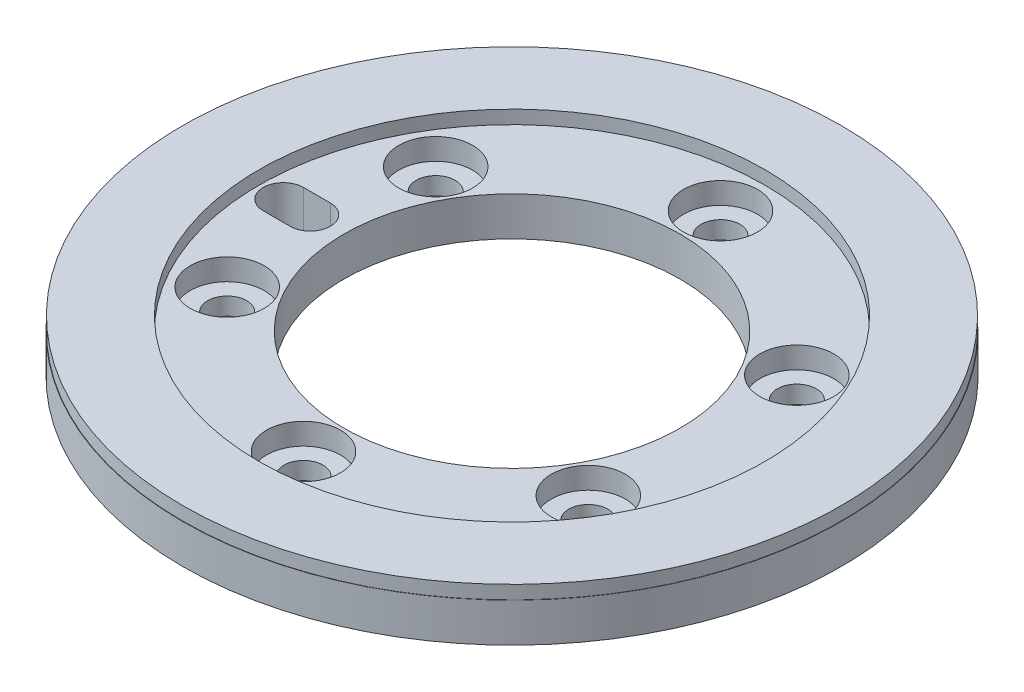
ISO-10303-21;
HEADER;
FILE_DESCRIPTION(('STEP AP214'),'2;1');
FILE_NAME('part.step','',(''),(''),'','','');
FILE_SCHEMA(('AUTOMOTIVE_DESIGN { 1 0 10303 214 1 1 1 1 }'));
ENDSEC;
DATA;
#1=APPLICATION_CONTEXT('core data for automotive mechanical design processes');
#2=APPLICATION_PROTOCOL_DEFINITION('international standard','automotive_design',2000,#1);
#3=PRODUCT_CONTEXT('',#1,'mechanical');
#4=PRODUCT('Part','Part','',(#3));
#5=PRODUCT_RELATED_PRODUCT_CATEGORY('part','',(#4));
#6=PRODUCT_DEFINITION_FORMATION('','',#4);
#7=PRODUCT_DEFINITION_CONTEXT('part definition',#1,'design');
#8=PRODUCT_DEFINITION('design','',#6,#7);
#9=PRODUCT_DEFINITION_SHAPE('','',#8);
#10=(LENGTH_UNIT() NAMED_UNIT(*) SI_UNIT(.MILLI.,.METRE.));
#11=(NAMED_UNIT(*) PLANE_ANGLE_UNIT() SI_UNIT($,.RADIAN.));
#12=(NAMED_UNIT(*) SI_UNIT($,.STERADIAN.) SOLID_ANGLE_UNIT());
#13=UNCERTAINTY_MEASURE_WITH_UNIT(LENGTH_MEASURE(1.E-05),#10,'distance_accuracy_value','');
#14=(GEOMETRIC_REPRESENTATION_CONTEXT(3) GLOBAL_UNCERTAINTY_ASSIGNED_CONTEXT((#13)) GLOBAL_UNIT_ASSIGNED_CONTEXT((#10,
#11,#12)) REPRESENTATION_CONTEXT('',''));
#15=CARTESIAN_POINT('',(0.,0.,0.));
#16=DIRECTION('',(0.,0.,1.));
#17=DIRECTION('',(1.,0.,0.));
#18=AXIS2_PLACEMENT_3D('',#15,#16,#17);
#19=CARTESIAN_POINT('',(-12.5,2.9,0.));
#20=DIRECTION('',(0.,-1.,0.));
#21=DIRECTION('',(0.,0.,-1.));
#22=AXIS2_PLACEMENT_3D('',#19,#20,#21);
#23=PLANE('',#22);
#24=CARTESIAN_POINT('',(0.,2.9,0.));
#25=DIRECTION('',(0.,-1.,0.));
#26=DIRECTION('',(0.,0.,-1.));
#27=AXIS2_PLACEMENT_3D('',#24,#25,#26);
#28=CIRCLE('',#27,24.5);
#29=CARTESIAN_POINT('',(0.,2.9,-24.5));
#30=VERTEX_POINT('',#29);
#31=EDGE_CURVE('E177',#30,#30,#28,.T.);
#32=ORIENTED_EDGE('',*,*,#31,.F.);
#33=EDGE_LOOP('',(#32));
#34=FACE_BOUND('',#33,.T.);
#35=CARTESIAN_POINT('',(0.,2.9,0.));
#36=DIRECTION('',(0.,-1.,0.));
#37=DIRECTION('',(0.,0.,-1.));
#38=AXIS2_PLACEMENT_3D('',#35,#36,#37);
#39=CIRCLE('',#38,24.475);
#40=CARTESIAN_POINT('',(0.,2.9,-24.475));
#41=VERTEX_POINT('',#40);
#42=EDGE_CURVE('E11',#41,#41,#39,.F.);
#43=ORIENTED_EDGE('',*,*,#42,.F.);
#44=EDGE_LOOP('',(#43));
#45=FACE_BOUND('',#44,.T.);
#46=ADVANCED_FACE('F31',(#34,#45),#23,.F.);
#47=CARTESIAN_POINT('',(0.,-3.24386032345393,0.));
#48=DIRECTION('',(0.,-1.,0.));
#49=DIRECTION('',(0.,0.,-1.));
#50=AXIS2_PLACEMENT_3D('',#47,#48,#49);
#51=CYLINDRICAL_SURFACE('',#50,12.5);
#52=CARTESIAN_POINT('',(0.,2.9,0.));
#53=DIRECTION('',(0.,-1.,0.));
#54=DIRECTION('',(0.,0.,-1.));
#55=AXIS2_PLACEMENT_3D('',#52,#53,#54);
#56=CIRCLE('',#55,12.5);
#57=CARTESIAN_POINT('',(0.,2.9,-12.5));
#58=VERTEX_POINT('',#57);
#59=EDGE_CURVE('E39',#58,#58,#56,.T.);
#60=ORIENTED_EDGE('',*,*,#59,.F.);
#61=EDGE_LOOP('',(#60));
#62=FACE_BOUND('',#61,.T.);
#63=CARTESIAN_POINT('',(0.,0.,0.));
#64=DIRECTION('',(0.,-1.,0.));
#65=DIRECTION('',(0.,0.,-1.));
#66=AXIS2_PLACEMENT_3D('',#63,#64,#65);
#67=CIRCLE('',#66,12.5);
#68=CARTESIAN_POINT('',(0.,0.,-12.5));
#69=VERTEX_POINT('',#68);
#70=EDGE_CURVE('E171',#69,#69,#67,.T.);
#71=ORIENTED_EDGE('',*,*,#70,.T.);
#72=EDGE_LOOP('',(#71));
#73=FACE_BOUND('',#72,.T.);
#74=ADVANCED_FACE('F33',(#62,#73),#51,.F.);
#75=CARTESIAN_POINT('',(0.,2.9,0.));
#76=DIRECTION('',(0.,1.,0.));
#77=DIRECTION('',(0.,0.,1.));
#78=AXIS2_PLACEMENT_3D('',#75,#76,#77);
#79=CIRCLE('',#78,18.8);
#80=CARTESIAN_POINT('',(0.,2.9,18.8));
#81=VERTEX_POINT('',#80);
#82=EDGE_CURVE('E235',#81,#81,#79,.T.);
#83=ORIENTED_EDGE('',*,*,#82,.T.);
#84=EDGE_LOOP('',(#83));
#85=FACE_BOUND('',#84,.T.);
#86=DIRECTION('',(-1.,0.,0.));
#87=VECTOR('',#86,1.);
#88=CARTESIAN_POINT('',(-15.,2.9,-1.5));
#89=LINE('',#88,#87);
#90=CARTESIAN_POINT('',(-15.,2.9,-1.5));
#91=VERTEX_POINT('',#90);
#92=CARTESIAN_POINT('',(-17.,2.9,-1.5));
#93=VERTEX_POINT('',#92);
#94=EDGE_CURVE('E102',#91,#93,#89,.T.);
#95=ORIENTED_EDGE('',*,*,#94,.F.);
#96=CARTESIAN_POINT('',(-15.,2.9,0.));
#97=DIRECTION('',(0.,1.,0.));
#98=DIRECTION('',(0.,0.,1.));
#99=AXIS2_PLACEMENT_3D('',#96,#97,#98);
#100=CIRCLE('',#99,1.5);
#101=CARTESIAN_POINT('',(-15.,2.9,1.5));
#102=VERTEX_POINT('',#101);
#103=EDGE_CURVE('E46',#102,#91,#100,.T.);
#104=ORIENTED_EDGE('',*,*,#103,.F.);
#105=DIRECTION('',(1.,0.,0.));
#106=VECTOR('',#105,1.);
#107=CARTESIAN_POINT('',(-15.,2.9,1.5));
#108=LINE('',#107,#106);
#109=CARTESIAN_POINT('',(-17.,2.9,1.5));
#110=VERTEX_POINT('',#109);
#111=EDGE_CURVE('E90',#110,#102,#108,.T.);
#112=ORIENTED_EDGE('',*,*,#111,.F.);
#113=CARTESIAN_POINT('',(-17.,2.9,0.));
#114=DIRECTION('',(0.,1.,0.));
#115=DIRECTION('',(0.,0.,1.));
#116=AXIS2_PLACEMENT_3D('',#113,#114,#115);
#117=CIRCLE('',#116,1.5);
#118=EDGE_CURVE('E93',#93,#110,#117,.T.);
#119=ORIENTED_EDGE('',*,*,#118,.F.);
#120=EDGE_LOOP('',(#95,#104,#112,#119));
#121=FACE_BOUND('',#120,.T.);
#122=CARTESIAN_POINT('',(-13.4233937586587,2.9,-7.75000000000016));
#123=DIRECTION('',(0.,-1.,0.));
#124=DIRECTION('',(0.,0.,-1.));
#125=AXIS2_PLACEMENT_3D('',#122,#123,#124);
#126=CIRCLE('',#125,2.75);
#127=CARTESIAN_POINT('',(-13.4233937586587,2.9,-10.5000000000002));
#128=VERTEX_POINT('',#127);
#129=EDGE_CURVE('E120',#128,#128,#126,.T.);
#130=ORIENTED_EDGE('',*,*,#129,.T.);
#131=EDGE_LOOP('',(#130));
#132=FACE_BOUND('',#131,.T.);
#133=CARTESIAN_POINT('',(-13.4233937586589,2.9,7.74999999999987));
#134=DIRECTION('',(0.,-1.,0.));
#135=DIRECTION('',(0.,0.,-1.));
#136=AXIS2_PLACEMENT_3D('',#133,#134,#135);
#137=CIRCLE('',#136,2.75);
#138=CARTESIAN_POINT('',(-13.4233937586589,2.9,4.99999999999988));
#139=VERTEX_POINT('',#138);
#140=EDGE_CURVE('E130',#139,#139,#137,.T.);
#141=ORIENTED_EDGE('',*,*,#140,.T.);
#142=EDGE_LOOP('',(#141));
#143=FACE_BOUND('',#142,.T.);
#144=CARTESIAN_POINT('',(0.,2.9,15.5));
#145=DIRECTION('',(0.,-1.,0.));
#146=DIRECTION('',(0.,0.,-1.));
#147=AXIS2_PLACEMENT_3D('',#144,#145,#146);
#148=CIRCLE('',#147,2.75);
#149=CARTESIAN_POINT('',(0.,2.9,12.75));
#150=VERTEX_POINT('',#149);
#151=EDGE_CURVE('E140',#150,#150,#148,.T.);
#152=ORIENTED_EDGE('',*,*,#151,.T.);
#153=EDGE_LOOP('',(#152));
#154=FACE_BOUND('',#153,.T.);
#155=CARTESIAN_POINT('',(13.4233937586588,2.9,7.75000000000006));
#156=DIRECTION('',(0.,-1.,0.));
#157=DIRECTION('',(0.,0.,-1.));
#158=AXIS2_PLACEMENT_3D('',#155,#156,#157);
#159=CIRCLE('',#158,2.75);
#160=CARTESIAN_POINT('',(13.4233937586588,2.9,5.00000000000006));
#161=VERTEX_POINT('',#160);
#162=EDGE_CURVE('E150',#161,#161,#159,.T.);
#163=ORIENTED_EDGE('',*,*,#162,.T.);
#164=EDGE_LOOP('',(#163));
#165=FACE_BOUND('',#164,.T.);
#166=CARTESIAN_POINT('',(13.4233937586588,2.9,-7.74999999999997));
#167=DIRECTION('',(0.,-1.,0.));
#168=DIRECTION('',(0.,0.,-1.));
#169=AXIS2_PLACEMENT_3D('',#166,#167,#168);
#170=CIRCLE('',#169,2.75);
#171=CARTESIAN_POINT('',(13.4233937586588,2.9,-10.5));
#172=VERTEX_POINT('',#171);
#173=EDGE_CURVE('E160',#172,#172,#170,.T.);
#174=ORIENTED_EDGE('',*,*,#173,.T.);
#175=EDGE_LOOP('',(#174));
#176=FACE_BOUND('',#175,.T.);
#177=CARTESIAN_POINT('',(0.,2.9,-15.5));
#178=DIRECTION('',(0.,-1.,0.));
#179=DIRECTION('',(0.,0.,-1.));
#180=AXIS2_PLACEMENT_3D('',#177,#178,#179);
#181=CIRCLE('',#180,2.75);
#182=CARTESIAN_POINT('',(0.,2.9,-18.25));
#183=VERTEX_POINT('',#182);
#184=EDGE_CURVE('E170',#183,#183,#181,.T.);
#185=ORIENTED_EDGE('',*,*,#184,.T.);
#186=EDGE_LOOP('',(#185));
#187=FACE_BOUND('',#186,.T.);
#188=ORIENTED_EDGE('',*,*,#59,.T.);
#189=EDGE_LOOP('',(#188));
#190=FACE_BOUND('',#189,.T.);
#191=ADVANCED_FACE('F194',(#85,#121,#132,#143,#154,#165,#176,#187,#190),#23,.F.);
#192=CARTESIAN_POINT('',(0.,-3.24386032345393,0.));
#193=DIRECTION('',(0.,-1.,0.));
#194=DIRECTION('',(0.,0.,-1.));
#195=AXIS2_PLACEMENT_3D('',#192,#193,#194);
#196=CYLINDRICAL_SURFACE('',#195,24.5);
#197=CARTESIAN_POINT('',(0.,0.,0.));
#198=DIRECTION('',(0.,-1.,0.));
#199=DIRECTION('',(0.,0.,-1.));
#200=AXIS2_PLACEMENT_3D('',#197,#198,#199);
#201=CIRCLE('',#200,24.5);
#202=CARTESIAN_POINT('',(0.,0.,-24.5));
#203=VERTEX_POINT('',#202);
#204=EDGE_CURVE('E174',#203,#203,#201,.T.);
#205=ORIENTED_EDGE('',*,*,#204,.F.);
#206=EDGE_LOOP('',(#205));
#207=FACE_BOUND('',#206,.T.);
#208=ORIENTED_EDGE('',*,*,#31,.T.);
#209=EDGE_LOOP('',(#208));
#210=FACE_BOUND('',#209,.T.);
#211=ADVANCED_FACE('F226',(#207,#210),#196,.T.);
#212=CARTESIAN_POINT('',(-12.5,0.,0.));
#213=DIRECTION('',(0.,1.,0.));
#214=DIRECTION('',(0.,0.,1.));
#215=AXIS2_PLACEMENT_3D('',#212,#213,#214);
#216=PLANE('',#215);
#217=DIRECTION('',(1.,0.,0.));
#218=VECTOR('',#217,1.);
#219=CARTESIAN_POINT('',(-15.,0.,1.5));
#220=LINE('',#219,#218);
#221=CARTESIAN_POINT('',(-17.,0.,1.5));
#222=VERTEX_POINT('',#221);
#223=CARTESIAN_POINT('',(-15.,0.,1.5));
#224=VERTEX_POINT('',#223);
#225=EDGE_CURVE('E80',#222,#224,#220,.T.);
#226=ORIENTED_EDGE('',*,*,#225,.T.);
#227=CARTESIAN_POINT('',(-15.,0.,0.));
#228=DIRECTION('',(0.,1.,0.));
#229=DIRECTION('',(0.,0.,1.));
#230=AXIS2_PLACEMENT_3D('',#227,#228,#229);
#231=CIRCLE('',#230,1.5);
#232=CARTESIAN_POINT('',(-15.,0.,-1.5));
#233=VERTEX_POINT('',#232);
#234=EDGE_CURVE('E74',#224,#233,#231,.T.);
#235=ORIENTED_EDGE('',*,*,#234,.T.);
#236=DIRECTION('',(-1.,0.,0.));
#237=VECTOR('',#236,1.);
#238=CARTESIAN_POINT('',(-15.,0.,-1.5));
#239=LINE('',#238,#237);
#240=CARTESIAN_POINT('',(-17.,0.,-1.5));
#241=VERTEX_POINT('',#240);
#242=EDGE_CURVE('E83',#233,#241,#239,.T.);
#243=ORIENTED_EDGE('',*,*,#242,.T.);
#244=CARTESIAN_POINT('',(-17.,0.,0.));
#245=DIRECTION('',(0.,1.,0.));
#246=DIRECTION('',(0.,0.,1.));
#247=AXIS2_PLACEMENT_3D('',#244,#245,#246);
#248=CIRCLE('',#247,1.5);
#249=EDGE_CURVE('E54',#241,#222,#248,.T.);
#250=ORIENTED_EDGE('',*,*,#249,.T.);
#251=EDGE_LOOP('',(#226,#235,#243,#250));
#252=FACE_BOUND('',#251,.T.);
#253=CARTESIAN_POINT('',(-13.4233937586587,0.,-7.75000000000016));
#254=DIRECTION('',(0.,1.,0.));
#255=DIRECTION('',(0.,0.,1.));
#256=AXIS2_PLACEMENT_3D('',#253,#254,#255);
#257=CIRCLE('',#256,1.45);
#258=CARTESIAN_POINT('',(-13.4233937586587,0.,-6.30000000000016));
#259=VERTEX_POINT('',#258);
#260=EDGE_CURVE('E117',#259,#259,#257,.T.);
#261=ORIENTED_EDGE('',*,*,#260,.T.);
#262=EDGE_LOOP('',(#261));
#263=FACE_BOUND('',#262,.T.);
#264=CARTESIAN_POINT('',(-13.4233937586589,0.,7.74999999999987));
#265=DIRECTION('',(0.,1.,0.));
#266=DIRECTION('',(0.,0.,1.));
#267=AXIS2_PLACEMENT_3D('',#264,#265,#266);
#268=CIRCLE('',#267,1.45);
#269=CARTESIAN_POINT('',(-13.4233937586589,0.,9.19999999999987));
#270=VERTEX_POINT('',#269);
#271=EDGE_CURVE('E127',#270,#270,#268,.T.);
#272=ORIENTED_EDGE('',*,*,#271,.T.);
#273=EDGE_LOOP('',(#272));
#274=FACE_BOUND('',#273,.T.);
#275=CARTESIAN_POINT('',(0.,0.,15.5));
#276=DIRECTION('',(0.,1.,0.));
#277=DIRECTION('',(0.,0.,1.));
#278=AXIS2_PLACEMENT_3D('',#275,#276,#277);
#279=CIRCLE('',#278,1.45);
#280=CARTESIAN_POINT('',(0.,0.,16.95));
#281=VERTEX_POINT('',#280);
#282=EDGE_CURVE('E137',#281,#281,#279,.T.);
#283=ORIENTED_EDGE('',*,*,#282,.T.);
#284=EDGE_LOOP('',(#283));
#285=FACE_BOUND('',#284,.T.);
#286=CARTESIAN_POINT('',(13.4233937586588,0.,7.75000000000006));
#287=DIRECTION('',(0.,1.,0.));
#288=DIRECTION('',(0.,0.,1.));
#289=AXIS2_PLACEMENT_3D('',#286,#287,#288);
#290=CIRCLE('',#289,1.45);
#291=CARTESIAN_POINT('',(13.4233937586588,0.,9.20000000000006));
#292=VERTEX_POINT('',#291);
#293=EDGE_CURVE('E147',#292,#292,#290,.T.);
#294=ORIENTED_EDGE('',*,*,#293,.T.);
#295=EDGE_LOOP('',(#294));
#296=FACE_BOUND('',#295,.T.);
#297=CARTESIAN_POINT('',(13.4233937586588,0.,-7.74999999999997));
#298=DIRECTION('',(0.,1.,0.));
#299=DIRECTION('',(0.,0.,1.));
#300=AXIS2_PLACEMENT_3D('',#297,#298,#299);
#301=CIRCLE('',#300,1.45);
#302=CARTESIAN_POINT('',(13.4233937586588,0.,-6.29999999999997));
#303=VERTEX_POINT('',#302);
#304=EDGE_CURVE('E157',#303,#303,#301,.T.);
#305=ORIENTED_EDGE('',*,*,#304,.T.);
#306=EDGE_LOOP('',(#305));
#307=FACE_BOUND('',#306,.T.);
#308=CARTESIAN_POINT('',(0.,0.,-15.5));
#309=DIRECTION('',(0.,1.,0.));
#310=DIRECTION('',(0.,0.,1.));
#311=AXIS2_PLACEMENT_3D('',#308,#309,#310);
#312=CIRCLE('',#311,1.45);
#313=CARTESIAN_POINT('',(0.,0.,-14.05));
#314=VERTEX_POINT('',#313);
#315=EDGE_CURVE('E167',#314,#314,#312,.T.);
#316=ORIENTED_EDGE('',*,*,#315,.T.);
#317=EDGE_LOOP('',(#316));
#318=FACE_BOUND('',#317,.T.);
#319=ORIENTED_EDGE('',*,*,#70,.F.);
#320=EDGE_LOOP('',(#319));
#321=FACE_BOUND('',#320,.T.);
#322=ORIENTED_EDGE('',*,*,#204,.T.);
#323=EDGE_LOOP('',(#322));
#324=FACE_BOUND('',#323,.T.);
#325=ADVANCED_FACE('F87',(#252,#263,#274,#285,#296,#307,#318,#321,#324),#216,.F.);
#326=CARTESIAN_POINT('',(0.,3.4,-15.5));
#327=DIRECTION('',(0.,1.,0.));
#328=DIRECTION('',(0.,0.,1.));
#329=AXIS2_PLACEMENT_3D('',#326,#327,#328);
#330=CYLINDRICAL_SURFACE('',#329,2.75);
#331=CARTESIAN_POINT('',(0.,1.3,-15.5));
#332=DIRECTION('',(0.,1.,0.));
#333=DIRECTION('',(0.,0.,1.));
#334=AXIS2_PLACEMENT_3D('',#331,#332,#333);
#335=CIRCLE('',#334,2.75);
#336=CARTESIAN_POINT('',(0.,1.3,-12.75));
#337=VERTEX_POINT('',#336);
#338=EDGE_CURVE('E161',#337,#337,#335,.T.);
#339=ORIENTED_EDGE('',*,*,#338,.F.);
#340=EDGE_LOOP('',(#339));
#341=FACE_BOUND('',#340,.T.);
#342=ORIENTED_EDGE('',*,*,#184,.F.);
#343=EDGE_LOOP('',(#342));
#344=FACE_BOUND('',#343,.T.);
#345=ADVANCED_FACE('F327',(#341,#344),#330,.F.);
#346=CARTESIAN_POINT('',(0.,3.4,-15.5));
#347=DIRECTION('',(0.,1.,0.));
#348=DIRECTION('',(0.,0.,1.));
#349=AXIS2_PLACEMENT_3D('',#346,#347,#348);
#350=CYLINDRICAL_SURFACE('',#349,1.45);
#351=ORIENTED_EDGE('',*,*,#315,.F.);
#352=EDGE_LOOP('',(#351));
#353=FACE_BOUND('',#352,.T.);
#354=CARTESIAN_POINT('',(0.,1.3,-15.5));
#355=DIRECTION('',(0.,1.,0.));
#356=DIRECTION('',(0.,0.,1.));
#357=AXIS2_PLACEMENT_3D('',#354,#355,#356);
#358=CIRCLE('',#357,1.45);
#359=CARTESIAN_POINT('',(0.,1.3,-14.05));
#360=VERTEX_POINT('',#359);
#361=EDGE_CURVE('E164',#360,#360,#358,.T.);
#362=ORIENTED_EDGE('',*,*,#361,.T.);
#363=EDGE_LOOP('',(#362));
#364=FACE_BOUND('',#363,.T.);
#365=ADVANCED_FACE('F470',(#353,#364),#350,.F.);
#366=CARTESIAN_POINT('',(1.45,1.3,-15.5));
#367=DIRECTION('',(0.,-1.,0.));
#368=DIRECTION('',(0.,0.,-1.));
#369=AXIS2_PLACEMENT_3D('',#366,#367,#368);
#370=PLANE('',#369);
#371=ORIENTED_EDGE('',*,*,#361,.F.);
#372=EDGE_LOOP('',(#371));
#373=FACE_BOUND('',#372,.T.);
#374=ORIENTED_EDGE('',*,*,#338,.T.);
#375=EDGE_LOOP('',(#374));
#376=FACE_BOUND('',#375,.T.);
#377=ADVANCED_FACE('F460',(#373,#376),#370,.F.);
#378=CARTESIAN_POINT('',(13.4233937586588,3.4,-7.74999999999997));
#379=DIRECTION('',(0.,1.,0.));
#380=DIRECTION('',(0.,0.,1.));
#381=AXIS2_PLACEMENT_3D('',#378,#379,#380);
#382=CYLINDRICAL_SURFACE('',#381,2.75);
#383=CARTESIAN_POINT('',(13.4233937586588,1.3,-7.74999999999997));
#384=DIRECTION('',(0.,1.,0.));
#385=DIRECTION('',(0.,0.,1.));
#386=AXIS2_PLACEMENT_3D('',#383,#384,#385);
#387=CIRCLE('',#386,2.75);
#388=CARTESIAN_POINT('',(13.4233937586588,1.3,-4.99999999999997));
#389=VERTEX_POINT('',#388);
#390=EDGE_CURVE('E151',#389,#389,#387,.T.);
#391=ORIENTED_EDGE('',*,*,#390,.F.);
#392=EDGE_LOOP('',(#391));
#393=FACE_BOUND('',#392,.T.);
#394=ORIENTED_EDGE('',*,*,#173,.F.);
#395=EDGE_LOOP('',(#394));
#396=FACE_BOUND('',#395,.T.);
#397=ADVANCED_FACE('F450',(#393,#396),#382,.F.);
#398=CARTESIAN_POINT('',(13.4233937586588,3.4,-7.74999999999997));
#399=DIRECTION('',(0.,1.,0.));
#400=DIRECTION('',(0.,0.,1.));
#401=AXIS2_PLACEMENT_3D('',#398,#399,#400);
#402=CYLINDRICAL_SURFACE('',#401,1.45);
#403=ORIENTED_EDGE('',*,*,#304,.F.);
#404=EDGE_LOOP('',(#403));
#405=FACE_BOUND('',#404,.T.);
#406=CARTESIAN_POINT('',(13.4233937586588,1.3,-7.74999999999997));
#407=DIRECTION('',(0.,1.,0.));
#408=DIRECTION('',(0.,0.,1.));
#409=AXIS2_PLACEMENT_3D('',#406,#407,#408);
#410=CIRCLE('',#409,1.45);
#411=CARTESIAN_POINT('',(13.4233937586588,1.3,-6.29999999999997));
#412=VERTEX_POINT('',#411);
#413=EDGE_CURVE('E154',#412,#412,#410,.T.);
#414=ORIENTED_EDGE('',*,*,#413,.T.);
#415=EDGE_LOOP('',(#414));
#416=FACE_BOUND('',#415,.T.);
#417=ADVANCED_FACE('F440',(#405,#416),#402,.F.);
#418=CARTESIAN_POINT('',(14.8733937586588,1.3,-7.74999999999997));
#419=DIRECTION('',(0.,-1.,0.));
#420=DIRECTION('',(0.,0.,-1.));
#421=AXIS2_PLACEMENT_3D('',#418,#419,#420);
#422=PLANE('',#421);
#423=ORIENTED_EDGE('',*,*,#413,.F.);
#424=EDGE_LOOP('',(#423));
#425=FACE_BOUND('',#424,.T.);
#426=ORIENTED_EDGE('',*,*,#390,.T.);
#427=EDGE_LOOP('',(#426));
#428=FACE_BOUND('',#427,.T.);
#429=ADVANCED_FACE('F430',(#425,#428),#422,.F.);
#430=CARTESIAN_POINT('',(13.4233937586588,3.4,7.75000000000006));
#431=DIRECTION('',(0.,1.,0.));
#432=DIRECTION('',(0.,0.,1.));
#433=AXIS2_PLACEMENT_3D('',#430,#431,#432);
#434=CYLINDRICAL_SURFACE('',#433,2.75);
#435=CARTESIAN_POINT('',(13.4233937586588,1.3,7.75000000000006));
#436=DIRECTION('',(0.,1.,0.));
#437=DIRECTION('',(0.,0.,1.));
#438=AXIS2_PLACEMENT_3D('',#435,#436,#437);
#439=CIRCLE('',#438,2.75);
#440=CARTESIAN_POINT('',(13.4233937586588,1.3,10.5000000000001));
#441=VERTEX_POINT('',#440);
#442=EDGE_CURVE('E141',#441,#441,#439,.T.);
#443=ORIENTED_EDGE('',*,*,#442,.F.);
#444=EDGE_LOOP('',(#443));
#445=FACE_BOUND('',#444,.T.);
#446=ORIENTED_EDGE('',*,*,#162,.F.);
#447=EDGE_LOOP('',(#446));
#448=FACE_BOUND('',#447,.T.);
#449=ADVANCED_FACE('F420',(#445,#448),#434,.F.);
#450=CARTESIAN_POINT('',(13.4233937586588,3.4,7.75000000000006));
#451=DIRECTION('',(0.,1.,0.));
#452=DIRECTION('',(0.,0.,1.));
#453=AXIS2_PLACEMENT_3D('',#450,#451,#452);
#454=CYLINDRICAL_SURFACE('',#453,1.45);
#455=ORIENTED_EDGE('',*,*,#293,.F.);
#456=EDGE_LOOP('',(#455));
#457=FACE_BOUND('',#456,.T.);
#458=CARTESIAN_POINT('',(13.4233937586588,1.3,7.75000000000006));
#459=DIRECTION('',(0.,1.,0.));
#460=DIRECTION('',(0.,0.,1.));
#461=AXIS2_PLACEMENT_3D('',#458,#459,#460);
#462=CIRCLE('',#461,1.45);
#463=CARTESIAN_POINT('',(13.4233937586588,1.3,9.20000000000006));
#464=VERTEX_POINT('',#463);
#465=EDGE_CURVE('E144',#464,#464,#462,.T.);
#466=ORIENTED_EDGE('',*,*,#465,.T.);
#467=EDGE_LOOP('',(#466));
#468=FACE_BOUND('',#467,.T.);
#469=ADVANCED_FACE('F410',(#457,#468),#454,.F.);
#470=CARTESIAN_POINT('',(14.8733937586588,1.3,7.75000000000006));
#471=DIRECTION('',(0.,-1.,0.));
#472=DIRECTION('',(0.,0.,-1.));
#473=AXIS2_PLACEMENT_3D('',#470,#471,#472);
#474=PLANE('',#473);
#475=ORIENTED_EDGE('',*,*,#465,.F.);
#476=EDGE_LOOP('',(#475));
#477=FACE_BOUND('',#476,.T.);
#478=ORIENTED_EDGE('',*,*,#442,.T.);
#479=EDGE_LOOP('',(#478));
#480=FACE_BOUND('',#479,.T.);
#481=ADVANCED_FACE('F400',(#477,#480),#474,.F.);
#482=CARTESIAN_POINT('',(0.,3.4,15.5));
#483=DIRECTION('',(0.,1.,0.));
#484=DIRECTION('',(0.,0.,1.));
#485=AXIS2_PLACEMENT_3D('',#482,#483,#484);
#486=CYLINDRICAL_SURFACE('',#485,2.75);
#487=CARTESIAN_POINT('',(0.,1.3,15.5));
#488=DIRECTION('',(0.,1.,0.));
#489=DIRECTION('',(0.,0.,1.));
#490=AXIS2_PLACEMENT_3D('',#487,#488,#489);
#491=CIRCLE('',#490,2.75);
#492=CARTESIAN_POINT('',(0.,1.3,18.25));
#493=VERTEX_POINT('',#492);
#494=EDGE_CURVE('E131',#493,#493,#491,.T.);
#495=ORIENTED_EDGE('',*,*,#494,.F.);
#496=EDGE_LOOP('',(#495));
#497=FACE_BOUND('',#496,.T.);
#498=ORIENTED_EDGE('',*,*,#151,.F.);
#499=EDGE_LOOP('',(#498));
#500=FACE_BOUND('',#499,.T.);
#501=ADVANCED_FACE('F390',(#497,#500),#486,.F.);
#502=CARTESIAN_POINT('',(0.,3.4,15.5));
#503=DIRECTION('',(0.,1.,0.));
#504=DIRECTION('',(0.,0.,1.));
#505=AXIS2_PLACEMENT_3D('',#502,#503,#504);
#506=CYLINDRICAL_SURFACE('',#505,1.45);
#507=ORIENTED_EDGE('',*,*,#282,.F.);
#508=EDGE_LOOP('',(#507));
#509=FACE_BOUND('',#508,.T.);
#510=CARTESIAN_POINT('',(0.,1.3,15.5));
#511=DIRECTION('',(0.,1.,0.));
#512=DIRECTION('',(0.,0.,1.));
#513=AXIS2_PLACEMENT_3D('',#510,#511,#512);
#514=CIRCLE('',#513,1.45);
#515=CARTESIAN_POINT('',(0.,1.3,16.95));
#516=VERTEX_POINT('',#515);
#517=EDGE_CURVE('E134',#516,#516,#514,.T.);
#518=ORIENTED_EDGE('',*,*,#517,.T.);
#519=EDGE_LOOP('',(#518));
#520=FACE_BOUND('',#519,.T.);
#521=ADVANCED_FACE('F380',(#509,#520),#506,.F.);
#522=CARTESIAN_POINT('',(1.45,1.3,15.5));
#523=DIRECTION('',(0.,-1.,0.));
#524=DIRECTION('',(0.,0.,-1.));
#525=AXIS2_PLACEMENT_3D('',#522,#523,#524);
#526=PLANE('',#525);
#527=ORIENTED_EDGE('',*,*,#517,.F.);
#528=EDGE_LOOP('',(#527));
#529=FACE_BOUND('',#528,.T.);
#530=ORIENTED_EDGE('',*,*,#494,.T.);
#531=EDGE_LOOP('',(#530));
#532=FACE_BOUND('',#531,.T.);
#533=ADVANCED_FACE('F370',(#529,#532),#526,.F.);
#534=CARTESIAN_POINT('',(-13.4233937586589,3.4,7.74999999999987));
#535=DIRECTION('',(0.,1.,0.));
#536=DIRECTION('',(0.,0.,1.));
#537=AXIS2_PLACEMENT_3D('',#534,#535,#536);
#538=CYLINDRICAL_SURFACE('',#537,2.75);
#539=CARTESIAN_POINT('',(-13.4233937586589,1.3,7.74999999999987));
#540=DIRECTION('',(0.,1.,0.));
#541=DIRECTION('',(0.,0.,1.));
#542=AXIS2_PLACEMENT_3D('',#539,#540,#541);
#543=CIRCLE('',#542,2.75);
#544=CARTESIAN_POINT('',(-13.4233937586589,1.3,10.4999999999999));
#545=VERTEX_POINT('',#544);
#546=EDGE_CURVE('E121',#545,#545,#543,.T.);
#547=ORIENTED_EDGE('',*,*,#546,.F.);
#548=EDGE_LOOP('',(#547));
#549=FACE_BOUND('',#548,.T.);
#550=ORIENTED_EDGE('',*,*,#140,.F.);
#551=EDGE_LOOP('',(#550));
#552=FACE_BOUND('',#551,.T.);
#553=ADVANCED_FACE('F360',(#549,#552),#538,.F.);
#554=CARTESIAN_POINT('',(-13.4233937586589,3.4,7.74999999999987));
#555=DIRECTION('',(0.,1.,0.));
#556=DIRECTION('',(0.,0.,1.));
#557=AXIS2_PLACEMENT_3D('',#554,#555,#556);
#558=CYLINDRICAL_SURFACE('',#557,1.45);
#559=ORIENTED_EDGE('',*,*,#271,.F.);
#560=EDGE_LOOP('',(#559));
#561=FACE_BOUND('',#560,.T.);
#562=CARTESIAN_POINT('',(-13.4233937586589,1.3,7.74999999999987));
#563=DIRECTION('',(0.,1.,0.));
#564=DIRECTION('',(0.,0.,1.));
#565=AXIS2_PLACEMENT_3D('',#562,#563,#564);
#566=CIRCLE('',#565,1.45);
#567=CARTESIAN_POINT('',(-13.4233937586589,1.3,9.19999999999987));
#568=VERTEX_POINT('',#567);
#569=EDGE_CURVE('E124',#568,#568,#566,.T.);
#570=ORIENTED_EDGE('',*,*,#569,.T.);
#571=EDGE_LOOP('',(#570));
#572=FACE_BOUND('',#571,.T.);
#573=ADVANCED_FACE('F210',(#561,#572),#558,.F.);
#574=CARTESIAN_POINT('',(-11.9733937586589,1.3,7.74999999999987));
#575=DIRECTION('',(0.,-1.,0.));
#576=DIRECTION('',(0.,0.,-1.));
#577=AXIS2_PLACEMENT_3D('',#574,#575,#576);
#578=PLANE('',#577);
#579=ORIENTED_EDGE('',*,*,#569,.F.);
#580=EDGE_LOOP('',(#579));
#581=FACE_BOUND('',#580,.T.);
#582=ORIENTED_EDGE('',*,*,#546,.T.);
#583=EDGE_LOOP('',(#582));
#584=FACE_BOUND('',#583,.T.);
#585=ADVANCED_FACE('F200',(#581,#584),#578,.F.);
#586=CARTESIAN_POINT('',(-13.4233937586587,3.4,-7.75000000000016));
#587=DIRECTION('',(0.,1.,0.));
#588=DIRECTION('',(0.,0.,1.));
#589=AXIS2_PLACEMENT_3D('',#586,#587,#588);
#590=CYLINDRICAL_SURFACE('',#589,2.75);
#591=CARTESIAN_POINT('',(-13.4233937586587,1.3,-7.75000000000016));
#592=DIRECTION('',(0.,1.,0.));
#593=DIRECTION('',(0.,0.,1.));
#594=AXIS2_PLACEMENT_3D('',#591,#592,#593);
#595=CIRCLE('',#594,2.75);
#596=CARTESIAN_POINT('',(-13.4233937586587,1.3,-5.00000000000016));
#597=VERTEX_POINT('',#596);
#598=EDGE_CURVE('E108',#597,#597,#595,.T.);
#599=ORIENTED_EDGE('',*,*,#598,.F.);
#600=EDGE_LOOP('',(#599));
#601=FACE_BOUND('',#600,.T.);
#602=ORIENTED_EDGE('',*,*,#129,.F.);
#603=EDGE_LOOP('',(#602));
#604=FACE_BOUND('',#603,.T.);
#605=ADVANCED_FACE('F197',(#601,#604),#590,.F.);
#606=CARTESIAN_POINT('',(-13.4233937586587,3.4,-7.75000000000016));
#607=DIRECTION('',(0.,1.,0.));
#608=DIRECTION('',(0.,0.,1.));
#609=AXIS2_PLACEMENT_3D('',#606,#607,#608);
#610=CYLINDRICAL_SURFACE('',#609,1.45);
#611=ORIENTED_EDGE('',*,*,#260,.F.);
#612=EDGE_LOOP('',(#611));
#613=FACE_BOUND('',#612,.T.);
#614=CARTESIAN_POINT('',(-13.4233937586587,1.3,-7.75000000000016));
#615=DIRECTION('',(0.,1.,0.));
#616=DIRECTION('',(0.,0.,1.));
#617=AXIS2_PLACEMENT_3D('',#614,#615,#616);
#618=CIRCLE('',#617,1.45);
#619=CARTESIAN_POINT('',(-13.4233937586587,1.3,-6.30000000000016));
#620=VERTEX_POINT('',#619);
#621=EDGE_CURVE('E114',#620,#620,#618,.T.);
#622=ORIENTED_EDGE('',*,*,#621,.T.);
#623=EDGE_LOOP('',(#622));
#624=FACE_BOUND('',#623,.T.);
#625=ADVANCED_FACE('F199',(#613,#624),#610,.F.);
#626=CARTESIAN_POINT('',(-11.9733937586587,1.3,-7.75000000000016));
#627=DIRECTION('',(0.,-1.,0.));
#628=DIRECTION('',(0.,0.,-1.));
#629=AXIS2_PLACEMENT_3D('',#626,#627,#628);
#630=PLANE('',#629);
#631=ORIENTED_EDGE('',*,*,#621,.F.);
#632=EDGE_LOOP('',(#631));
#633=FACE_BOUND('',#632,.T.);
#634=ORIENTED_EDGE('',*,*,#598,.T.);
#635=EDGE_LOOP('',(#634));
#636=FACE_BOUND('',#635,.T.);
#637=ADVANCED_FACE('F207',(#633,#636),#630,.F.);
#638=CARTESIAN_POINT('',(-15.,0.,0.));
#639=DIRECTION('',(0.,1.,0.));
#640=DIRECTION('',(0.,0.,1.));
#641=AXIS2_PLACEMENT_3D('',#638,#639,#640);
#642=CYLINDRICAL_SURFACE('',#641,1.5);
#643=ORIENTED_EDGE('',*,*,#103,.T.);
#644=DIRECTION('',(0.,1.,0.));
#645=VECTOR('',#644,1.);
#646=CARTESIAN_POINT('',(-15.,0.,-1.5));
#647=LINE('',#646,#645);
#648=EDGE_CURVE('E70',#233,#91,#647,.T.);
#649=ORIENTED_EDGE('',*,*,#648,.F.);
#650=ORIENTED_EDGE('',*,*,#234,.F.);
#651=DIRECTION('',(0.,1.,0.));
#652=VECTOR('',#651,1.);
#653=CARTESIAN_POINT('',(-15.,0.,1.5));
#654=LINE('',#653,#652);
#655=EDGE_CURVE('E106',#224,#102,#654,.T.);
#656=ORIENTED_EDGE('',*,*,#655,.T.);
#657=EDGE_LOOP('',(#643,#649,#650,#656));
#658=FACE_BOUND('',#657,.T.);
#659=ADVANCED_FACE('F72',(#658),#642,.F.);
#660=CARTESIAN_POINT('',(-15.,0.,1.5));
#661=DIRECTION('',(0.,0.,1.));
#662=DIRECTION('',(1.,0.,0.));
#663=AXIS2_PLACEMENT_3D('',#660,#661,#662);
#664=PLANE('',#663);
#665=ORIENTED_EDGE('',*,*,#111,.T.);
#666=ORIENTED_EDGE('',*,*,#655,.F.);
#667=ORIENTED_EDGE('',*,*,#225,.F.);
#668=DIRECTION('',(0.,1.,0.));
#669=VECTOR('',#668,1.);
#670=CARTESIAN_POINT('',(-17.,0.,1.5));
#671=LINE('',#670,#669);
#672=EDGE_CURVE('E109',#222,#110,#671,.T.);
#673=ORIENTED_EDGE('',*,*,#672,.T.);
#674=EDGE_LOOP('',(#665,#666,#667,#673));
#675=FACE_BOUND('',#674,.T.);
#676=ADVANCED_FACE('F240',(#675),#664,.F.);
#677=CARTESIAN_POINT('',(-17.,0.,0.));
#678=DIRECTION('',(0.,1.,0.));
#679=DIRECTION('',(0.,0.,1.));
#680=AXIS2_PLACEMENT_3D('',#677,#678,#679);
#681=CYLINDRICAL_SURFACE('',#680,1.5);
#682=ORIENTED_EDGE('',*,*,#118,.T.);
#683=ORIENTED_EDGE('',*,*,#672,.F.);
#684=ORIENTED_EDGE('',*,*,#249,.F.);
#685=DIRECTION('',(0.,1.,0.));
#686=VECTOR('',#685,1.);
#687=CARTESIAN_POINT('',(-17.,0.,-1.5));
#688=LINE('',#687,#686);
#689=EDGE_CURVE('E79',#241,#93,#688,.T.);
#690=ORIENTED_EDGE('',*,*,#689,.T.);
#691=EDGE_LOOP('',(#682,#683,#684,#690));
#692=FACE_BOUND('',#691,.T.);
#693=ADVANCED_FACE('F238',(#692),#681,.F.);
#694=CARTESIAN_POINT('',(-15.,0.,-1.5));
#695=DIRECTION('',(0.,0.,-1.));
#696=DIRECTION('',(-1.,0.,0.));
#697=AXIS2_PLACEMENT_3D('',#694,#695,#696);
#698=PLANE('',#697);
#699=ORIENTED_EDGE('',*,*,#94,.T.);
#700=ORIENTED_EDGE('',*,*,#689,.F.);
#701=ORIENTED_EDGE('',*,*,#242,.F.);
#702=ORIENTED_EDGE('',*,*,#648,.T.);
#703=EDGE_LOOP('',(#699,#700,#701,#702));
#704=FACE_BOUND('',#703,.T.);
#705=ADVANCED_FACE('F84',(#704),#698,.F.);
#706=CARTESIAN_POINT('',(0.,3.9,0.));
#707=DIRECTION('',(0.,1.,0.));
#708=DIRECTION('',(0.,0.,1.));
#709=AXIS2_PLACEMENT_3D('',#706,#707,#708);
#710=PLANE('',#709);
#711=CARTESIAN_POINT('',(0.,3.9,0.));
#712=DIRECTION('',(0.,1.,0.));
#713=DIRECTION('',(0.,0.,1.));
#714=AXIS2_PLACEMENT_3D('',#711,#712,#713);
#715=CIRCLE('',#714,24.475);
#716=CARTESIAN_POINT('',(0.,3.9,24.475));
#717=VERTEX_POINT('',#716);
#718=EDGE_CURVE('E96',#717,#717,#715,.T.);
#719=ORIENTED_EDGE('',*,*,#718,.T.);
#720=EDGE_LOOP('',(#719));
#721=FACE_BOUND('',#720,.T.);
#722=CARTESIAN_POINT('',(0.,3.9,0.));
#723=DIRECTION('',(0.,1.,0.));
#724=DIRECTION('',(0.,0.,1.));
#725=AXIS2_PLACEMENT_3D('',#722,#723,#724);
#726=CIRCLE('',#725,18.8);
#727=CARTESIAN_POINT('',(0.,3.9,18.8));
#728=VERTEX_POINT('',#727);
#729=EDGE_CURVE('E273',#728,#728,#726,.T.);
#730=ORIENTED_EDGE('',*,*,#729,.F.);
#731=EDGE_LOOP('',(#730));
#732=FACE_BOUND('',#731,.T.);
#733=ADVANCED_FACE('F253',(#721,#732),#710,.T.);
#734=CARTESIAN_POINT('',(0.,3.9,0.));
#735=DIRECTION('',(0.,-1.,0.));
#736=DIRECTION('',(0.,0.,-1.));
#737=AXIS2_PLACEMENT_3D('',#734,#735,#736);
#738=CYLINDRICAL_SURFACE('',#737,24.475);
#739=ORIENTED_EDGE('',*,*,#718,.F.);
#740=EDGE_LOOP('',(#739));
#741=FACE_BOUND('',#740,.T.);
#742=ORIENTED_EDGE('',*,*,#42,.T.);
#743=EDGE_LOOP('',(#742));
#744=FACE_BOUND('',#743,.T.);
#745=ADVANCED_FACE('F249',(#741,#744),#738,.T.);
#746=CARTESIAN_POINT('',(0.,3.9,0.));
#747=DIRECTION('',(0.,-1.,0.));
#748=DIRECTION('',(0.,0.,-1.));
#749=AXIS2_PLACEMENT_3D('',#746,#747,#748);
#750=CYLINDRICAL_SURFACE('',#749,18.8);
#751=ORIENTED_EDGE('',*,*,#729,.T.);
#752=EDGE_LOOP('',(#751));
#753=FACE_BOUND('',#752,.T.);
#754=ORIENTED_EDGE('',*,*,#82,.F.);
#755=EDGE_LOOP('',(#754));
#756=FACE_BOUND('',#755,.T.);
#757=ADVANCED_FACE('F261',(#753,#756),#750,.F.);
#758=CLOSED_SHELL('',(#46,#74,#191,#211,#325,#345,#365,#377,#397,#417,#429,#449,#469,#481,#501,
#521,#533,#553,#573,#585,#605,#625,#637,#659,#676,#693,#705,#733,#745,#757));
#759=MANIFOLD_SOLID_BREP('B2',#758);
#760=ADVANCED_BREP_SHAPE_REPRESENTATION('',(#18,#759),#14);
#761=SHAPE_DEFINITION_REPRESENTATION(#9,#760);
ENDSEC;
END-ISO-10303-21;
